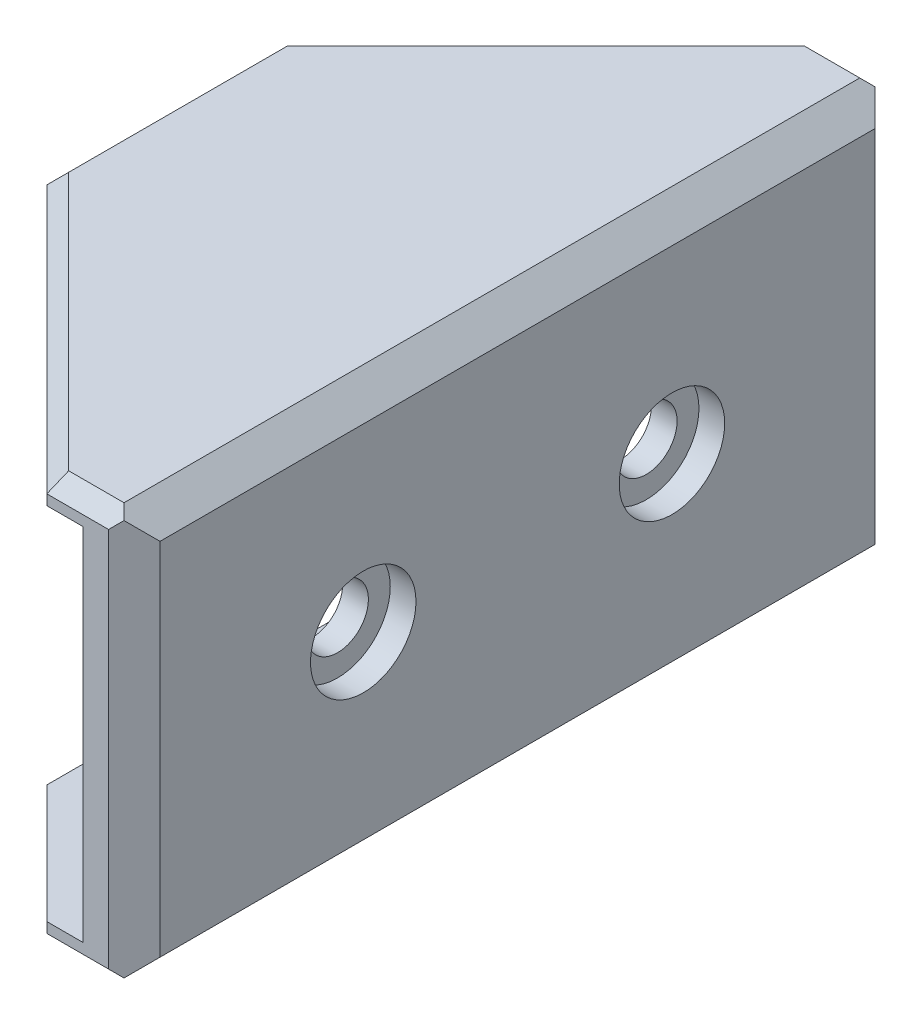
ISO-10303-21;
HEADER;
FILE_DESCRIPTION(('STEP AP214'),'2;1');
FILE_NAME('part.step','',(''),(''),'','','');
FILE_SCHEMA(('AUTOMOTIVE_DESIGN { 1 0 10303 214 1 1 1 1 }'));
ENDSEC;
DATA;
#1=APPLICATION_CONTEXT('core data for automotive mechanical design processes');
#2=APPLICATION_PROTOCOL_DEFINITION('international standard','automotive_design',2000,#1);
#3=PRODUCT_CONTEXT('',#1,'mechanical');
#4=PRODUCT('Part','Part','',(#3));
#5=PRODUCT_RELATED_PRODUCT_CATEGORY('part','',(#4));
#6=PRODUCT_DEFINITION_FORMATION('','',#4);
#7=PRODUCT_DEFINITION_CONTEXT('part definition',#1,'design');
#8=PRODUCT_DEFINITION('design','',#6,#7);
#9=PRODUCT_DEFINITION_SHAPE('','',#8);
#10=(LENGTH_UNIT() NAMED_UNIT(*) SI_UNIT(.MILLI.,.METRE.));
#11=(NAMED_UNIT(*) PLANE_ANGLE_UNIT() SI_UNIT($,.RADIAN.));
#12=(NAMED_UNIT(*) SI_UNIT($,.STERADIAN.) SOLID_ANGLE_UNIT());
#13=UNCERTAINTY_MEASURE_WITH_UNIT(LENGTH_MEASURE(1.E-05),#10,'distance_accuracy_value','');
#14=(GEOMETRIC_REPRESENTATION_CONTEXT(3) GLOBAL_UNCERTAINTY_ASSIGNED_CONTEXT((#13)) GLOBAL_UNIT_ASSIGNED_CONTEXT((#10,
#11,#12)) REPRESENTATION_CONTEXT('',''));
#15=CARTESIAN_POINT('',(0.,0.,0.));
#16=DIRECTION('',(0.,0.,1.));
#17=DIRECTION('',(1.,0.,0.));
#18=AXIS2_PLACEMENT_3D('',#15,#16,#17);
#19=CARTESIAN_POINT('',(-10.401,8.,-20.9));
#20=DIRECTION('',(1.,0.,0.));
#21=DIRECTION('',(0.,0.,-1.));
#22=AXIS2_PLACEMENT_3D('',#19,#20,#21);
#23=CYLINDRICAL_SURFACE('',#22,1.2);
#24=CARTESIAN_POINT('',(1.4,8.,-20.9));
#25=DIRECTION('',(1.,0.,0.));
#26=DIRECTION('',(0.,0.,-1.));
#27=AXIS2_PLACEMENT_3D('',#24,#25,#26);
#28=CIRCLE('',#27,1.2);
#29=CARTESIAN_POINT('',(1.4,8.,-22.1));
#30=VERTEX_POINT('',#29);
#31=EDGE_CURVE('E354',#30,#30,#28,.F.);
#32=ORIENTED_EDGE('',*,*,#31,.T.);
#33=EDGE_LOOP('',(#32));
#34=FACE_BOUND('',#33,.T.);
#35=CARTESIAN_POINT('',(2.4,8.,-20.9));
#36=DIRECTION('',(1.,0.,0.));
#37=DIRECTION('',(0.,0.,-1.));
#38=AXIS2_PLACEMENT_3D('',#35,#36,#37);
#39=CIRCLE('',#38,1.2);
#40=CARTESIAN_POINT('',(2.4,8.,-22.1));
#41=VERTEX_POINT('',#40);
#42=EDGE_CURVE('E44',#41,#41,#39,.F.);
#43=ORIENTED_EDGE('',*,*,#42,.F.);
#44=EDGE_LOOP('',(#43));
#45=FACE_BOUND('',#44,.T.);
#46=ADVANCED_FACE('F39',(#34,#45),#23,.F.);
#47=CARTESIAN_POINT('',(-10.401,8.,-8.9));
#48=DIRECTION('',(1.,0.,0.));
#49=DIRECTION('',(0.,0.,-1.));
#50=AXIS2_PLACEMENT_3D('',#47,#48,#49);
#51=CYLINDRICAL_SURFACE('',#50,1.2);
#52=CARTESIAN_POINT('',(1.4,8.,-8.9));
#53=DIRECTION('',(1.,0.,0.));
#54=DIRECTION('',(0.,0.,-1.));
#55=AXIS2_PLACEMENT_3D('',#52,#53,#54);
#56=CIRCLE('',#55,1.2);
#57=CARTESIAN_POINT('',(1.4,8.,-10.1));
#58=VERTEX_POINT('',#57);
#59=EDGE_CURVE('E341',#58,#58,#56,.F.);
#60=ORIENTED_EDGE('',*,*,#59,.T.);
#61=EDGE_LOOP('',(#60));
#62=FACE_BOUND('',#61,.T.);
#63=CARTESIAN_POINT('',(2.4,8.,-8.9));
#64=DIRECTION('',(1.,0.,0.));
#65=DIRECTION('',(0.,0.,-1.));
#66=AXIS2_PLACEMENT_3D('',#63,#64,#65);
#67=CIRCLE('',#66,1.2);
#68=CARTESIAN_POINT('',(2.4,8.,-10.1));
#69=VERTEX_POINT('',#68);
#70=EDGE_CURVE('E348',#69,#69,#67,.F.);
#71=ORIENTED_EDGE('',*,*,#70,.F.);
#72=EDGE_LOOP('',(#71));
#73=FACE_BOUND('',#72,.T.);
#74=ADVANCED_FACE('F502',(#62,#73),#51,.F.);
#75=CARTESIAN_POINT('',(-14.9,16.,-14.8999999999998));
#76=DIRECTION('',(0.707106781186552,0.,0.707106781186544));
#77=DIRECTION('',(0.707106781186544,0.,-0.707106781186551));
#78=AXIS2_PLACEMENT_3D('',#75,#76,#77);
#79=PLANE('',#78);
#80=DIRECTION('',(0.,-1.,0.));
#81=VECTOR('',#80,1.);
#82=CARTESIAN_POINT('',(0.,16.,-29.8));
#83=LINE('',#82,#81);
#84=CARTESIAN_POINT('',(0.,1.,-29.8));
#85=VERTEX_POINT('',#84);
#86=CARTESIAN_POINT('',(0.,0.600000000000003,-29.8));
#87=VERTEX_POINT('',#86);
#88=EDGE_CURVE('E238',#85,#87,#83,.T.);
#89=ORIENTED_EDGE('',*,*,#88,.T.);
#90=DIRECTION('',(-0.707106781186544,0.,0.707106781186551));
#91=VECTOR('',#90,1.);
#92=CARTESIAN_POINT('',(-14.9,0.600000000000003,-14.8999999999998));
#93=LINE('',#92,#91);
#94=CARTESIAN_POINT('',(-4.6,0.600000000000003,-25.2));
#95=VERTEX_POINT('',#94);
#96=EDGE_CURVE('E209',#87,#95,#93,.T.);
#97=ORIENTED_EDGE('',*,*,#96,.T.);
#98=DIRECTION('',(0.,-1.,0.));
#99=VECTOR('',#98,1.);
#100=CARTESIAN_POINT('',(-4.6,16.,-25.2));
#101=LINE('',#100,#99);
#102=CARTESIAN_POINT('',(-4.6,1.,-25.2));
#103=VERTEX_POINT('',#102);
#104=EDGE_CURVE('E192',#103,#95,#101,.T.);
#105=ORIENTED_EDGE('',*,*,#104,.F.);
#106=DIRECTION('',(-0.707106781186544,0.,0.707106781186551));
#107=VECTOR('',#106,1.);
#108=CARTESIAN_POINT('',(-14.9,1.,-14.8999999999998));
#109=LINE('',#108,#107);
#110=EDGE_CURVE('E206',#85,#103,#109,.T.);
#111=ORIENTED_EDGE('',*,*,#110,.F.);
#112=EDGE_LOOP('',(#89,#97,#105,#111));
#113=FACE_BOUND('',#112,.T.);
#114=ADVANCED_FACE('F205',(#113),#79,.F.);
#115=CARTESIAN_POINT('',(0.,16.,0.));
#116=DIRECTION('',(0.707106781186551,0.,-0.707106781186544));
#117=DIRECTION('',(-0.707106781186544,0.,-0.707106781186551));
#118=AXIS2_PLACEMENT_3D('',#115,#116,#117);
#119=PLANE('',#118);
#120=DIRECTION('',(0.,1.,0.));
#121=VECTOR('',#120,1.);
#122=CARTESIAN_POINT('',(-4.6,16.,-4.60000000000004));
#123=LINE('',#122,#121);
#124=CARTESIAN_POINT('',(-4.6,0.600000000000003,-4.60000000000004));
#125=VERTEX_POINT('',#124);
#126=CARTESIAN_POINT('',(-4.6,1.,-4.60000000000004));
#127=VERTEX_POINT('',#126);
#128=EDGE_CURVE('E195',#125,#127,#123,.T.);
#129=ORIENTED_EDGE('',*,*,#128,.F.);
#130=DIRECTION('',(0.707106781186544,0.,0.707106781186551));
#131=VECTOR('',#130,1.);
#132=CARTESIAN_POINT('',(0.,0.600000000000003,0.));
#133=LINE('',#132,#131);
#134=CARTESIAN_POINT('',(0.,0.600000000000003,0.));
#135=VERTEX_POINT('',#134);
#136=EDGE_CURVE('E295',#125,#135,#133,.T.);
#137=ORIENTED_EDGE('',*,*,#136,.T.);
#138=DIRECTION('',(0.,-1.,0.));
#139=VECTOR('',#138,1.);
#140=CARTESIAN_POINT('',(0.,16.,0.));
#141=LINE('',#140,#139);
#142=CARTESIAN_POINT('',(0.,1.,0.));
#143=VERTEX_POINT('',#142);
#144=EDGE_CURVE('E231',#143,#135,#141,.T.);
#145=ORIENTED_EDGE('',*,*,#144,.F.);
#146=DIRECTION('',(0.707106781186544,0.,0.707106781186551));
#147=VECTOR('',#146,1.);
#148=CARTESIAN_POINT('',(0.,1.,0.));
#149=LINE('',#148,#147);
#150=EDGE_CURVE('E210',#127,#143,#149,.T.);
#151=ORIENTED_EDGE('',*,*,#150,.F.);
#152=EDGE_LOOP('',(#129,#137,#145,#151));
#153=FACE_BOUND('',#152,.T.);
#154=ADVANCED_FACE('F445',(#153),#119,.F.);
#155=CARTESIAN_POINT('',(0.,0.,0.));
#156=DIRECTION('',(0.,1.,0.));
#157=DIRECTION('',(0.,0.,1.));
#158=AXIS2_PLACEMENT_3D('',#155,#156,#157);
#159=PLANE('',#158);
#160=DIRECTION('',(0.,0.,1.));
#161=VECTOR('',#160,1.);
#162=CARTESIAN_POINT('',(2.40000000000001,0.,0.));
#163=LINE('',#162,#161);
#164=CARTESIAN_POINT('',(2.4,0.,-29.2));
#165=VERTEX_POINT('',#164);
#166=CARTESIAN_POINT('',(2.40000000000001,0.,-0.600000000000008));
#167=VERTEX_POINT('',#166);
#168=EDGE_CURVE('E258',#165,#167,#163,.T.);
#169=ORIENTED_EDGE('',*,*,#168,.T.);
#170=DIRECTION('',(-1.,0.,0.));
#171=VECTOR('',#170,1.);
#172=CARTESIAN_POINT('',(0.,0.,-0.600000000000008));
#173=LINE('',#172,#171);
#174=CARTESIAN_POINT('',(0.248528137423862,0.,-0.600000000000008));
#175=VERTEX_POINT('',#174);
#176=EDGE_CURVE('E280',#167,#175,#173,.T.);
#177=ORIENTED_EDGE('',*,*,#176,.T.);
#178=DIRECTION('',(-0.707106781186544,0.,-0.707106781186551));
#179=VECTOR('',#178,1.);
#180=CARTESIAN_POINT('',(0.424264068711937,0.,-0.424264068711933));
#181=LINE('',#180,#179);
#182=CARTESIAN_POINT('',(-3.99999999999999,0.,-4.8485281374239));
#183=VERTEX_POINT('',#182);
#184=EDGE_CURVE('E278',#175,#183,#181,.T.);
#185=ORIENTED_EDGE('',*,*,#184,.T.);
#186=DIRECTION('',(0.,0.,-1.));
#187=VECTOR('',#186,1.);
#188=CARTESIAN_POINT('',(-3.99999999999999,0.,-25.2));
#189=LINE('',#188,#187);
#190=CARTESIAN_POINT('',(-3.99999999999999,0.,-24.9514718625761));
#191=VERTEX_POINT('',#190);
#192=EDGE_CURVE('E276',#183,#191,#189,.T.);
#193=ORIENTED_EDGE('',*,*,#192,.T.);
#194=DIRECTION('',(0.707106781186544,0.,-0.707106781186551));
#195=VECTOR('',#194,1.);
#196=CARTESIAN_POINT('',(-14.4757359312881,0.,-14.4757359312879));
#197=LINE('',#196,#195);
#198=CARTESIAN_POINT('',(0.248528137423864,0.,-29.2));
#199=VERTEX_POINT('',#198);
#200=EDGE_CURVE('E261',#191,#199,#197,.T.);
#201=ORIENTED_EDGE('',*,*,#200,.T.);
#202=DIRECTION('',(1.,0.,0.));
#203=VECTOR('',#202,1.);
#204=CARTESIAN_POINT('',(2.4,0.,-29.2));
#205=LINE('',#204,#203);
#206=EDGE_CURVE('E274',#199,#165,#205,.T.);
#207=ORIENTED_EDGE('',*,*,#206,.T.);
#208=EDGE_LOOP('',(#169,#177,#185,#193,#201,#207));
#209=FACE_BOUND('',#208,.T.);
#210=ADVANCED_FACE('F458',(#209),#159,.F.);
#211=CARTESIAN_POINT('',(0.,1.,0.));
#212=DIRECTION('',(0.,1.,0.));
#213=DIRECTION('',(0.,0.,1.));
#214=AXIS2_PLACEMENT_3D('',#211,#212,#213);
#215=PLANE('',#214);
#216=ORIENTED_EDGE('',*,*,#110,.T.);
#217=DIRECTION('',(0.,0.,1.));
#218=VECTOR('',#217,1.);
#219=CARTESIAN_POINT('',(-4.6,1.,0.));
#220=LINE('',#219,#218);
#221=EDGE_CURVE('E189',#103,#127,#220,.T.);
#222=ORIENTED_EDGE('',*,*,#221,.T.);
#223=ORIENTED_EDGE('',*,*,#150,.T.);
#224=DIRECTION('',(-1.,0.,0.));
#225=VECTOR('',#224,1.);
#226=CARTESIAN_POINT('',(0.,1.,0.));
#227=LINE('',#226,#225);
#228=CARTESIAN_POINT('',(1.4,1.,0.));
#229=VERTEX_POINT('',#228);
#230=EDGE_CURVE('E388',#229,#143,#227,.T.);
#231=ORIENTED_EDGE('',*,*,#230,.F.);
#232=DIRECTION('',(0.,0.,1.));
#233=VECTOR('',#232,1.);
#234=CARTESIAN_POINT('',(1.4,1.,0.));
#235=LINE('',#234,#233);
#236=CARTESIAN_POINT('',(1.4,1.,-29.8));
#237=VERTEX_POINT('',#236);
#238=EDGE_CURVE('E221',#237,#229,#235,.T.);
#239=ORIENTED_EDGE('',*,*,#238,.F.);
#240=DIRECTION('',(1.,0.,0.));
#241=VECTOR('',#240,1.);
#242=CARTESIAN_POINT('',(0.,1.,-29.8));
#243=LINE('',#242,#241);
#244=EDGE_CURVE('E215',#85,#237,#243,.T.);
#245=ORIENTED_EDGE('',*,*,#244,.F.);
#246=EDGE_LOOP('',(#216,#222,#223,#231,#239,#245));
#247=FACE_BOUND('',#246,.T.);
#248=ADVANCED_FACE('F212',(#247),#215,.T.);
#249=CARTESIAN_POINT('',(0.,16.,0.));
#250=DIRECTION('',(0.,0.,1.));
#251=DIRECTION('',(1.,0.,0.));
#252=AXIS2_PLACEMENT_3D('',#249,#250,#251);
#253=PLANE('',#252);
#254=ORIENTED_EDGE('',*,*,#144,.T.);
#255=DIRECTION('',(1.,0.,0.));
#256=VECTOR('',#255,1.);
#257=CARTESIAN_POINT('',(2.40000000000001,0.600000000000003,0.));
#258=LINE('',#257,#256);
#259=CARTESIAN_POINT('',(2.40000000000001,0.600000000000003,0.));
#260=VERTEX_POINT('',#259);
#261=EDGE_CURVE('E285',#135,#260,#258,.T.);
#262=ORIENTED_EDGE('',*,*,#261,.T.);
#263=DIRECTION('',(0.,1.,0.));
#264=VECTOR('',#263,1.);
#265=CARTESIAN_POINT('',(2.40000000000001,16.,0.));
#266=LINE('',#265,#264);
#267=CARTESIAN_POINT('',(2.40000000000001,15.4,0.));
#268=VERTEX_POINT('',#267);
#269=EDGE_CURVE('E255',#260,#268,#266,.T.);
#270=ORIENTED_EDGE('',*,*,#269,.T.);
#271=DIRECTION('',(-1.,0.,0.));
#272=VECTOR('',#271,1.);
#273=CARTESIAN_POINT('',(0.,15.4,0.));
#274=LINE('',#273,#272);
#275=CARTESIAN_POINT('',(0.,15.4,0.));
#276=VERTEX_POINT('',#275);
#277=EDGE_CURVE('E283',#268,#276,#274,.T.);
#278=ORIENTED_EDGE('',*,*,#277,.T.);
#279=CARTESIAN_POINT('',(0.,15.,0.));
#280=VERTEX_POINT('',#279);
#281=EDGE_CURVE('E232',#276,#280,#141,.T.);
#282=ORIENTED_EDGE('',*,*,#281,.T.);
#283=DIRECTION('',(-1.,0.,0.));
#284=VECTOR('',#283,1.);
#285=CARTESIAN_POINT('',(0.,15.,0.));
#286=LINE('',#285,#284);
#287=CARTESIAN_POINT('',(1.4,15.,0.));
#288=VERTEX_POINT('',#287);
#289=EDGE_CURVE('E376',#288,#280,#286,.T.);
#290=ORIENTED_EDGE('',*,*,#289,.F.);
#291=DIRECTION('',(0.,-1.,0.));
#292=VECTOR('',#291,1.);
#293=CARTESIAN_POINT('',(1.4,15.,0.));
#294=LINE('',#293,#292);
#295=EDGE_CURVE('E227',#288,#229,#294,.T.);
#296=ORIENTED_EDGE('',*,*,#295,.T.);
#297=ORIENTED_EDGE('',*,*,#230,.T.);
#298=EDGE_LOOP('',(#254,#262,#270,#278,#282,#290,#296,#297));
#299=FACE_BOUND('',#298,.T.);
#300=ADVANCED_FACE('F397',(#299),#253,.T.);
#301=CARTESIAN_POINT('',(3.4,16.,0.));
#302=DIRECTION('',(1.,0.,0.));
#303=DIRECTION('',(0.,0.,-1.));
#304=AXIS2_PLACEMENT_3D('',#301,#302,#303);
#305=PLANE('',#304);
#306=CARTESIAN_POINT('',(3.4,8.,-8.9));
#307=DIRECTION('',(1.,0.,0.));
#308=DIRECTION('',(0.,0.,-1.));
#309=AXIS2_PLACEMENT_3D('',#306,#307,#308);
#310=CIRCLE('',#309,2.05);
#311=CARTESIAN_POINT('',(3.4,8.,-10.95));
#312=VERTEX_POINT('',#311);
#313=EDGE_CURVE('E356',#312,#312,#310,.T.);
#314=ORIENTED_EDGE('',*,*,#313,.F.);
#315=EDGE_LOOP('',(#314));
#316=FACE_BOUND('',#315,.T.);
#317=CARTESIAN_POINT('',(3.4,8.,-20.9));
#318=DIRECTION('',(1.,0.,0.));
#319=DIRECTION('',(0.,0.,-1.));
#320=AXIS2_PLACEMENT_3D('',#317,#318,#319);
#321=CIRCLE('',#320,2.05);
#322=CARTESIAN_POINT('',(3.4,8.,-22.95));
#323=VERTEX_POINT('',#322);
#324=EDGE_CURVE('E366',#323,#323,#321,.T.);
#325=ORIENTED_EDGE('',*,*,#324,.F.);
#326=EDGE_LOOP('',(#325));
#327=FACE_BOUND('',#326,.T.);
#328=DIRECTION('',(0.,0.,-1.));
#329=VECTOR('',#328,1.);
#330=CARTESIAN_POINT('',(3.4,0.999999999999997,-29.8));
#331=LINE('',#330,#329);
#332=CARTESIAN_POINT('',(3.4,0.999999999999997,-0.999999999999998));
#333=VERTEX_POINT('',#332);
#334=CARTESIAN_POINT('',(3.4,0.999999999999997,-28.8));
#335=VERTEX_POINT('',#334);
#336=EDGE_CURVE('E242',#333,#335,#331,.T.);
#337=ORIENTED_EDGE('',*,*,#336,.T.);
#338=DIRECTION('',(0.,1.,0.));
#339=VECTOR('',#338,1.);
#340=CARTESIAN_POINT('',(3.4,16.,-28.8));
#341=LINE('',#340,#339);
#342=CARTESIAN_POINT('',(3.4,15.,-28.8));
#343=VERTEX_POINT('',#342);
#344=EDGE_CURVE('E249',#335,#343,#341,.T.);
#345=ORIENTED_EDGE('',*,*,#344,.T.);
#346=DIRECTION('',(0.,0.,1.));
#347=VECTOR('',#346,1.);
#348=CARTESIAN_POINT('',(3.4,15.,0.));
#349=LINE('',#348,#347);
#350=CARTESIAN_POINT('',(3.4,15.,-0.999999999999998));
#351=VERTEX_POINT('',#350);
#352=EDGE_CURVE('E246',#343,#351,#349,.T.);
#353=ORIENTED_EDGE('',*,*,#352,.T.);
#354=DIRECTION('',(0.,-1.,0.));
#355=VECTOR('',#354,1.);
#356=CARTESIAN_POINT('',(3.4,16.,-0.999999999999998));
#357=LINE('',#356,#355);
#358=EDGE_CURVE('E244',#351,#333,#357,.T.);
#359=ORIENTED_EDGE('',*,*,#358,.T.);
#360=EDGE_LOOP('',(#337,#345,#353,#359));
#361=FACE_BOUND('',#360,.T.);
#362=ADVANCED_FACE('F489',(#316,#327,#361),#305,.T.);
#363=CARTESIAN_POINT('',(0.,16.,-29.8));
#364=DIRECTION('',(0.,0.,-1.));
#365=DIRECTION('',(-1.,0.,0.));
#366=AXIS2_PLACEMENT_3D('',#363,#364,#365);
#367=PLANE('',#366);
#368=DIRECTION('',(0.,-1.,0.));
#369=VECTOR('',#368,1.);
#370=CARTESIAN_POINT('',(2.4,16.,-29.8));
#371=LINE('',#370,#369);
#372=CARTESIAN_POINT('',(2.4,15.4,-29.8));
#373=VERTEX_POINT('',#372);
#374=CARTESIAN_POINT('',(2.4,0.600000000000003,-29.8));
#375=VERTEX_POINT('',#374);
#376=EDGE_CURVE('E199',#373,#375,#371,.T.);
#377=ORIENTED_EDGE('',*,*,#376,.T.);
#378=DIRECTION('',(-1.,0.,0.));
#379=VECTOR('',#378,1.);
#380=CARTESIAN_POINT('',(0.,0.600000000000003,-29.8));
#381=LINE('',#380,#379);
#382=EDGE_CURVE('E306',#375,#87,#381,.T.);
#383=ORIENTED_EDGE('',*,*,#382,.T.);
#384=ORIENTED_EDGE('',*,*,#88,.F.);
#385=ORIENTED_EDGE('',*,*,#244,.T.);
#386=DIRECTION('',(0.,-1.,0.));
#387=VECTOR('',#386,1.);
#388=CARTESIAN_POINT('',(1.4,15.,-29.8));
#389=LINE('',#388,#387);
#390=CARTESIAN_POINT('',(1.4,15.,-29.8));
#391=VERTEX_POINT('',#390);
#392=EDGE_CURVE('E225',#391,#237,#389,.T.);
#393=ORIENTED_EDGE('',*,*,#392,.F.);
#394=DIRECTION('',(1.,0.,0.));
#395=VECTOR('',#394,1.);
#396=CARTESIAN_POINT('',(0.,15.,-29.8));
#397=LINE('',#396,#395);
#398=CARTESIAN_POINT('',(0.,15.,-29.8));
#399=VERTEX_POINT('',#398);
#400=EDGE_CURVE('E382',#399,#391,#397,.T.);
#401=ORIENTED_EDGE('',*,*,#400,.F.);
#402=CARTESIAN_POINT('',(0.,15.4,-29.8));
#403=VERTEX_POINT('',#402);
#404=EDGE_CURVE('E200',#403,#399,#83,.T.);
#405=ORIENTED_EDGE('',*,*,#404,.F.);
#406=DIRECTION('',(1.,0.,0.));
#407=VECTOR('',#406,1.);
#408=CARTESIAN_POINT('',(0.,15.4,-29.8));
#409=LINE('',#408,#407);
#410=EDGE_CURVE('E303',#403,#373,#409,.T.);
#411=ORIENTED_EDGE('',*,*,#410,.T.);
#412=EDGE_LOOP('',(#377,#383,#384,#385,#393,#401,#405,#411));
#413=FACE_BOUND('',#412,.T.);
#414=ADVANCED_FACE('F426',(#413),#367,.T.);
#415=DIRECTION('',(0.,-1.,0.));
#416=VECTOR('',#415,1.);
#417=CARTESIAN_POINT('',(-10.4,16.,-19.3999999999999));
#418=LINE('',#417,#416);
#419=CARTESIAN_POINT('',(-10.4,15.4,-19.3999999999999));
#420=VERTEX_POINT('',#419);
#421=CARTESIAN_POINT('',(-10.4,15.,-19.3999999999999));
#422=VERTEX_POINT('',#421);
#423=EDGE_CURVE('E236',#420,#422,#418,.T.);
#424=ORIENTED_EDGE('',*,*,#423,.F.);
#425=DIRECTION('',(0.707106781186544,0.,-0.707106781186551));
#426=VECTOR('',#425,1.);
#427=CARTESIAN_POINT('',(0.,15.4,-29.8));
#428=LINE('',#427,#426);
#429=EDGE_CURVE('E323',#420,#403,#428,.T.);
#430=ORIENTED_EDGE('',*,*,#429,.T.);
#431=ORIENTED_EDGE('',*,*,#404,.T.);
#432=DIRECTION('',(-0.707106781186544,0.,0.707106781186551));
#433=VECTOR('',#432,1.);
#434=CARTESIAN_POINT('',(-14.9,15.,-14.8999999999998));
#435=LINE('',#434,#433);
#436=EDGE_CURVE('E228',#399,#422,#435,.T.);
#437=ORIENTED_EDGE('',*,*,#436,.T.);
#438=EDGE_LOOP('',(#424,#430,#431,#437));
#439=FACE_BOUND('',#438,.T.);
#440=ADVANCED_FACE('F422',(#439),#79,.F.);
#441=CARTESIAN_POINT('',(-10.4,16.,0.));
#442=DIRECTION('',(1.,0.,0.));
#443=DIRECTION('',(0.,0.,-1.));
#444=AXIS2_PLACEMENT_3D('',#441,#442,#443);
#445=PLANE('',#444);
#446=DIRECTION('',(0.,-1.,0.));
#447=VECTOR('',#446,1.);
#448=CARTESIAN_POINT('',(-10.4,16.,-10.4000000000001));
#449=LINE('',#448,#447);
#450=CARTESIAN_POINT('',(-10.4,15.4,-10.4000000000001));
#451=VERTEX_POINT('',#450);
#452=CARTESIAN_POINT('',(-10.4,15.,-10.4000000000001));
#453=VERTEX_POINT('',#452);
#454=EDGE_CURVE('E234',#451,#453,#449,.T.);
#455=ORIENTED_EDGE('',*,*,#454,.F.);
#456=DIRECTION('',(0.,0.,-1.));
#457=VECTOR('',#456,1.);
#458=CARTESIAN_POINT('',(-10.4,15.4,-19.3999999999999));
#459=LINE('',#458,#457);
#460=EDGE_CURVE('E11',#451,#420,#459,.T.);
#461=ORIENTED_EDGE('',*,*,#460,.T.);
#462=ORIENTED_EDGE('',*,*,#423,.T.);
#463=DIRECTION('',(0.,0.,1.));
#464=VECTOR('',#463,1.);
#465=CARTESIAN_POINT('',(-10.4,15.,0.));
#466=LINE('',#465,#464);
#467=EDGE_CURVE('E216',#422,#453,#466,.T.);
#468=ORIENTED_EDGE('',*,*,#467,.T.);
#469=EDGE_LOOP('',(#455,#461,#462,#468));
#470=FACE_BOUND('',#469,.T.);
#471=ADVANCED_FACE('F406',(#470),#445,.F.);
#472=ORIENTED_EDGE('',*,*,#281,.F.);
#473=DIRECTION('',(-0.707106781186544,0.,-0.707106781186551));
#474=VECTOR('',#473,1.);
#475=CARTESIAN_POINT('',(-10.4,15.4,-10.4000000000001));
#476=LINE('',#475,#474);
#477=EDGE_CURVE('E49',#276,#451,#476,.T.);
#478=ORIENTED_EDGE('',*,*,#477,.T.);
#479=ORIENTED_EDGE('',*,*,#454,.T.);
#480=DIRECTION('',(0.707106781186544,0.,0.707106781186551));
#481=VECTOR('',#480,1.);
#482=CARTESIAN_POINT('',(0.,15.,0.));
#483=LINE('',#482,#481);
#484=EDGE_CURVE('E219',#453,#280,#483,.T.);
#485=ORIENTED_EDGE('',*,*,#484,.T.);
#486=EDGE_LOOP('',(#472,#478,#479,#485));
#487=FACE_BOUND('',#486,.T.);
#488=ADVANCED_FACE('F403',(#487),#119,.F.);
#489=CARTESIAN_POINT('',(0.,16.,0.));
#490=DIRECTION('',(0.,1.,0.));
#491=DIRECTION('',(0.,0.,1.));
#492=AXIS2_PLACEMENT_3D('',#489,#490,#491);
#493=PLANE('',#492);
#494=DIRECTION('',(0.,0.,-1.));
#495=VECTOR('',#494,1.);
#496=CARTESIAN_POINT('',(2.40000000000001,16.,0.));
#497=LINE('',#496,#495);
#498=CARTESIAN_POINT('',(2.40000000000001,16.,-0.6));
#499=VERTEX_POINT('',#498);
#500=CARTESIAN_POINT('',(2.4,16.,-29.2));
#501=VERTEX_POINT('',#500);
#502=EDGE_CURVE('E252',#499,#501,#497,.T.);
#503=ORIENTED_EDGE('',*,*,#502,.T.);
#504=DIRECTION('',(-1.,0.,0.));
#505=VECTOR('',#504,1.);
#506=CARTESIAN_POINT('',(0.,16.,-29.2));
#507=LINE('',#506,#505);
#508=CARTESIAN_POINT('',(0.248528137423853,16.,-29.2));
#509=VERTEX_POINT('',#508);
#510=EDGE_CURVE('E321',#501,#509,#507,.T.);
#511=ORIENTED_EDGE('',*,*,#510,.T.);
#512=DIRECTION('',(-0.707106781186544,0.,0.707106781186551));
#513=VECTOR('',#512,1.);
#514=CARTESIAN_POINT('',(-9.97573593128807,16.,-18.975735931288));
#515=LINE('',#514,#513);
#516=CARTESIAN_POINT('',(-9.8,16.,-19.151471862576));
#517=VERTEX_POINT('',#516);
#518=EDGE_CURVE('E317',#509,#517,#515,.T.);
#519=ORIENTED_EDGE('',*,*,#518,.T.);
#520=DIRECTION('',(0.,0.,1.));
#521=VECTOR('',#520,1.);
#522=CARTESIAN_POINT('',(-9.8,16.,-10.4000000000001));
#523=LINE('',#522,#521);
#524=CARTESIAN_POINT('',(-9.8,16.,-10.648528137424));
#525=VERTEX_POINT('',#524);
#526=EDGE_CURVE('E313',#517,#525,#523,.T.);
#527=ORIENTED_EDGE('',*,*,#526,.T.);
#528=DIRECTION('',(0.707106781186544,0.,0.707106781186551));
#529=VECTOR('',#528,1.);
#530=CARTESIAN_POINT('',(0.424264068711931,16.,-0.424264068711926));
#531=LINE('',#530,#529);
#532=CARTESIAN_POINT('',(0.248528137423859,16.,-0.6));
#533=VERTEX_POINT('',#532);
#534=EDGE_CURVE('E315',#525,#533,#531,.T.);
#535=ORIENTED_EDGE('',*,*,#534,.T.);
#536=DIRECTION('',(1.,0.,0.));
#537=VECTOR('',#536,1.);
#538=CARTESIAN_POINT('',(0.,16.,-0.6));
#539=LINE('',#538,#537);
#540=EDGE_CURVE('E319',#533,#499,#539,.T.);
#541=ORIENTED_EDGE('',*,*,#540,.T.);
#542=EDGE_LOOP('',(#503,#511,#519,#527,#535,#541));
#543=FACE_BOUND('',#542,.T.);
#544=ADVANCED_FACE('F476',(#543),#493,.T.);
#545=CARTESIAN_POINT('',(1.4,15.,0.));
#546=DIRECTION('',(1.,0.,0.));
#547=DIRECTION('',(0.,0.,-1.));
#548=AXIS2_PLACEMENT_3D('',#545,#546,#547);
#549=PLANE('',#548);
#550=ORIENTED_EDGE('',*,*,#59,.F.);
#551=EDGE_LOOP('',(#550));
#552=FACE_BOUND('',#551,.T.);
#553=ORIENTED_EDGE('',*,*,#31,.F.);
#554=EDGE_LOOP('',(#553));
#555=FACE_BOUND('',#554,.T.);
#556=ORIENTED_EDGE('',*,*,#238,.T.);
#557=ORIENTED_EDGE('',*,*,#295,.F.);
#558=DIRECTION('',(0.,0.,1.));
#559=VECTOR('',#558,1.);
#560=CARTESIAN_POINT('',(1.4,15.,0.));
#561=LINE('',#560,#559);
#562=EDGE_CURVE('E379',#391,#288,#561,.T.);
#563=ORIENTED_EDGE('',*,*,#562,.F.);
#564=ORIENTED_EDGE('',*,*,#392,.T.);
#565=EDGE_LOOP('',(#556,#557,#563,#564));
#566=FACE_BOUND('',#565,.T.);
#567=ADVANCED_FACE('F392',(#552,#555,#566),#549,.F.);
#568=CARTESIAN_POINT('',(0.,15.,0.));
#569=DIRECTION('',(0.,1.,0.));
#570=DIRECTION('',(0.,0.,1.));
#571=AXIS2_PLACEMENT_3D('',#568,#569,#570);
#572=PLANE('',#571);
#573=ORIENTED_EDGE('',*,*,#467,.F.);
#574=ORIENTED_EDGE('',*,*,#436,.F.);
#575=ORIENTED_EDGE('',*,*,#400,.T.);
#576=ORIENTED_EDGE('',*,*,#562,.T.);
#577=ORIENTED_EDGE('',*,*,#289,.T.);
#578=ORIENTED_EDGE('',*,*,#484,.F.);
#579=EDGE_LOOP('',(#573,#574,#575,#576,#577,#578));
#580=FACE_BOUND('',#579,.T.);
#581=ADVANCED_FACE('F402',(#580),#572,.F.);
#582=CARTESIAN_POINT('',(-4.6,0.,0.));
#583=DIRECTION('',(-1.,0.,0.));
#584=DIRECTION('',(0.,0.,1.));
#585=AXIS2_PLACEMENT_3D('',#582,#583,#584);
#586=PLANE('',#585);
#587=ORIENTED_EDGE('',*,*,#104,.T.);
#588=DIRECTION('',(0.,0.,1.));
#589=VECTOR('',#588,1.);
#590=CARTESIAN_POINT('',(-4.6,0.600000000000003,-4.60000000000004));
#591=LINE('',#590,#589);
#592=EDGE_CURVE('E297',#95,#125,#591,.T.);
#593=ORIENTED_EDGE('',*,*,#592,.T.);
#594=ORIENTED_EDGE('',*,*,#128,.T.);
#595=ORIENTED_EDGE('',*,*,#221,.F.);
#596=EDGE_LOOP('',(#587,#593,#594,#595));
#597=FACE_BOUND('',#596,.T.);
#598=ADVANCED_FACE('F191',(#597),#586,.T.);
#599=CARTESIAN_POINT('',(3.4,16.,-0.999999999999998));
#600=DIRECTION('',(-0.707106781186548,0.,-0.707106781186547));
#601=DIRECTION('',(0.,-1.,0.));
#602=AXIS2_PLACEMENT_3D('',#599,#600,#601);
#603=PLANE('',#602);
#604=ORIENTED_EDGE('',*,*,#269,.F.);
#605=DIRECTION('',(-0.577350269189627,0.577350269189623,0.577350269189627));
#606=VECTOR('',#605,1.);
#607=CARTESIAN_POINT('',(-2.06666666666664,5.06666666666661,4.46666666666665));
#608=LINE('',#607,#606);
#609=CARTESIAN_POINT('',(2.70000000000001,0.300000000000003,-0.300000000000003));
#610=VERTEX_POINT('',#609);
#611=EDGE_CURVE('E289',#260,#610,#608,.F.);
#612=ORIENTED_EDGE('',*,*,#611,.T.);
#613=DIRECTION('',(0.577350269189626,0.577350269189626,-0.577350269189626));
#614=VECTOR('',#613,1.);
#615=CARTESIAN_POINT('',(2.40000000000001,0.,0.));
#616=LINE('',#615,#614);
#617=EDGE_CURVE('E268',#333,#610,#616,.F.);
#618=ORIENTED_EDGE('',*,*,#617,.F.);
#619=ORIENTED_EDGE('',*,*,#358,.F.);
#620=DIRECTION('',(-0.577350269189626,0.577350269189626,0.577350269189626));
#621=VECTOR('',#620,1.);
#622=CARTESIAN_POINT('',(3.06666666666667,15.3333333333333,-0.666666666666665));
#623=LINE('',#622,#621);
#624=CARTESIAN_POINT('',(2.70000000000001,15.7,-0.300000000000002));
#625=VERTEX_POINT('',#624);
#626=EDGE_CURVE('E271',#625,#351,#623,.F.);
#627=ORIENTED_EDGE('',*,*,#626,.F.);
#628=DIRECTION('',(-0.577350269189625,-0.577350269189628,0.577350269189625));
#629=VECTOR('',#628,1.);
#630=CARTESIAN_POINT('',(3.26666666666667,16.2666666666667,-0.866666666666664));
#631=LINE('',#630,#629);
#632=EDGE_CURVE('E287',#625,#268,#631,.T.);
#633=ORIENTED_EDGE('',*,*,#632,.T.);
#634=EDGE_LOOP('',(#604,#612,#618,#619,#627,#633));
#635=FACE_BOUND('',#634,.T.);
#636=ADVANCED_FACE('F467',(#635),#603,.F.);
#637=CARTESIAN_POINT('',(3.4,15.,0.));
#638=DIRECTION('',(-0.707106781186548,-0.707106781186548,0.));
#639=DIRECTION('',(0.,0.,1.));
#640=AXIS2_PLACEMENT_3D('',#637,#638,#639);
#641=PLANE('',#640);
#642=DIRECTION('',(-0.577350269189626,0.577350269189626,-0.577350269189626));
#643=VECTOR('',#642,1.);
#644=CARTESIAN_POINT('',(13.,5.4,-19.2));
#645=LINE('',#644,#643);
#646=CARTESIAN_POINT('',(2.7,15.7,-29.5));
#647=VERTEX_POINT('',#646);
#648=EDGE_CURVE('E265',#647,#343,#645,.F.);
#649=ORIENTED_EDGE('',*,*,#648,.F.);
#650=DIRECTION('',(-0.577350269189627,0.577350269189627,0.577350269189624));
#651=VECTOR('',#650,1.);
#652=CARTESIAN_POINT('',(-6.66666666666664,25.0666666666666,-20.1333333333334));
#653=LINE('',#652,#651);
#654=EDGE_CURVE('E311',#647,#501,#653,.T.);
#655=ORIENTED_EDGE('',*,*,#654,.T.);
#656=ORIENTED_EDGE('',*,*,#502,.F.);
#657=DIRECTION('',(0.577350269189627,-0.577350269189627,0.577350269189624));
#658=VECTOR('',#657,1.);
#659=CARTESIAN_POINT('',(3.26666666666667,15.1333333333333,0.266666666666662));
#660=LINE('',#659,#658);
#661=EDGE_CURVE('E309',#499,#625,#660,.T.);
#662=ORIENTED_EDGE('',*,*,#661,.T.);
#663=ORIENTED_EDGE('',*,*,#626,.T.);
#664=ORIENTED_EDGE('',*,*,#352,.F.);
#665=EDGE_LOOP('',(#649,#655,#656,#662,#663,#664));
#666=FACE_BOUND('',#665,.T.);
#667=ADVANCED_FACE('F480',(#666),#641,.F.);
#668=CARTESIAN_POINT('',(2.40000000000001,0.,0.));
#669=DIRECTION('',(0.707106781186548,-0.707106781186548,0.));
#670=DIRECTION('',(0.,0.,-1.));
#671=AXIS2_PLACEMENT_3D('',#668,#669,#670);
#672=PLANE('',#671);
#673=ORIENTED_EDGE('',*,*,#617,.T.);
#674=DIRECTION('',(-0.577350269189624,-0.577350269189624,-0.577350269189629));
#675=VECTOR('',#674,1.);
#676=CARTESIAN_POINT('',(2.60000000000001,0.200000000000003,-0.400000000000003));
#677=LINE('',#676,#675);
#678=EDGE_CURVE('E293',#610,#167,#677,.T.);
#679=ORIENTED_EDGE('',*,*,#678,.T.);
#680=ORIENTED_EDGE('',*,*,#168,.F.);
#681=DIRECTION('',(0.577350269189625,0.577350269189625,-0.577350269189628));
#682=VECTOR('',#681,1.);
#683=CARTESIAN_POINT('',(-7.33333333333335,-9.73333333333335,-19.4666666666666));
#684=LINE('',#683,#682);
#685=CARTESIAN_POINT('',(2.7,0.300000000000002,-29.5));
#686=VERTEX_POINT('',#685);
#687=EDGE_CURVE('E291',#165,#686,#684,.T.);
#688=ORIENTED_EDGE('',*,*,#687,.T.);
#689=DIRECTION('',(-0.577350269189626,-0.577350269189626,-0.577350269189626));
#690=VECTOR('',#689,1.);
#691=CARTESIAN_POINT('',(12.3333333333333,9.93333333333333,-19.8666666666667));
#692=LINE('',#691,#690);
#693=EDGE_CURVE('E262',#335,#686,#692,.T.);
#694=ORIENTED_EDGE('',*,*,#693,.F.);
#695=ORIENTED_EDGE('',*,*,#336,.F.);
#696=EDGE_LOOP('',(#673,#679,#680,#688,#694,#695));
#697=FACE_BOUND('',#696,.T.);
#698=ADVANCED_FACE('F461',(#697),#672,.T.);
#699=CARTESIAN_POINT('',(2.4,16.,-29.8));
#700=DIRECTION('',(-0.707106781186548,0.,0.707106781186548));
#701=DIRECTION('',(0.,-1.,0.));
#702=AXIS2_PLACEMENT_3D('',#699,#700,#701);
#703=PLANE('',#702);
#704=ORIENTED_EDGE('',*,*,#693,.T.);
#705=DIRECTION('',(0.577350269189627,-0.577350269189624,0.577350269189627));
#706=VECTOR('',#705,1.);
#707=CARTESIAN_POINT('',(-2.73333333333332,5.7333333333333,-34.9333333333333));
#708=LINE('',#707,#706);
#709=EDGE_CURVE('E301',#686,#375,#708,.F.);
#710=ORIENTED_EDGE('',*,*,#709,.T.);
#711=ORIENTED_EDGE('',*,*,#376,.F.);
#712=DIRECTION('',(0.577350269189625,0.577350269189628,0.577350269189625));
#713=VECTOR('',#712,1.);
#714=CARTESIAN_POINT('',(2.6,15.6,-29.6));
#715=LINE('',#714,#713);
#716=EDGE_CURVE('E299',#373,#647,#715,.T.);
#717=ORIENTED_EDGE('',*,*,#716,.T.);
#718=ORIENTED_EDGE('',*,*,#648,.T.);
#719=ORIENTED_EDGE('',*,*,#344,.F.);
#720=EDGE_LOOP('',(#704,#710,#711,#717,#718,#719));
#721=FACE_BOUND('',#720,.T.);
#722=ADVANCED_FACE('F486',(#721),#703,.F.);
#723=CARTESIAN_POINT('',(0.,0.,-29.2));
#724=DIRECTION('',(0.,-0.70710678118655,-0.707106781186545));
#725=DIRECTION('',(-1.,0.,0.));
#726=AXIS2_PLACEMENT_3D('',#723,#724,#725);
#727=PLANE('',#726);
#728=ORIENTED_EDGE('',*,*,#687,.F.);
#729=ORIENTED_EDGE('',*,*,#206,.F.);
#730=DIRECTION('',(-0.281084637714831,0.678598344545843,-0.678598344545847));
#731=VECTOR('',#730,1.);
#732=CARTESIAN_POINT('',(1.66485144444203,-3.41930693650823,-25.7806930634917));
#733=LINE('',#732,#731);
#734=EDGE_CURVE('E266',#87,#199,#733,.F.);
#735=ORIENTED_EDGE('',*,*,#734,.F.);
#736=ORIENTED_EDGE('',*,*,#382,.F.);
#737=ORIENTED_EDGE('',*,*,#709,.F.);
#738=EDGE_LOOP('',(#728,#729,#735,#736,#737));
#739=FACE_BOUND('',#738,.T.);
#740=ADVANCED_FACE('F433',(#739),#727,.T.);
#741=CARTESIAN_POINT('',(-14.9,0.600000000000003,-14.8999999999998));
#742=DIRECTION('',(0.499999999999999,0.707106781186553,0.499999999999994));
#743=DIRECTION('',(-0.707106781186544,0.,0.707106781186551));
#744=AXIS2_PLACEMENT_3D('',#741,#742,#743);
#745=PLANE('',#744);
#746=ORIENTED_EDGE('',*,*,#734,.T.);
#747=ORIENTED_EDGE('',*,*,#200,.F.);
#748=DIRECTION('',(0.678598344545849,-0.678598344545843,0.281084637714824));
#749=VECTOR('',#748,1.);
#750=CARTESIAN_POINT('',(-7.3784470769151,3.37844707691508,-26.3508704615941));
#751=LINE('',#750,#749);
#752=EDGE_CURVE('E332',#95,#191,#751,.T.);
#753=ORIENTED_EDGE('',*,*,#752,.F.);
#754=ORIENTED_EDGE('',*,*,#96,.F.);
#755=EDGE_LOOP('',(#746,#747,#753,#754));
#756=FACE_BOUND('',#755,.T.);
#757=ADVANCED_FACE('F437',(#756),#745,.F.);
#758=CARTESIAN_POINT('',(-4.6,0.600000000000003,0.));
#759=DIRECTION('',(-0.707106781186544,-0.707106781186551,0.));
#760=DIRECTION('',(0.,0.,-1.));
#761=AXIS2_PLACEMENT_3D('',#758,#759,#760);
#762=PLANE('',#761);
#763=ORIENTED_EDGE('',*,*,#752,.T.);
#764=ORIENTED_EDGE('',*,*,#192,.F.);
#765=DIRECTION('',(0.67859834454585,-0.678598344545844,-0.281084637714819));
#766=VECTOR('',#765,1.);
#767=CARTESIAN_POINT('',(-5.47742042122052,1.47742042122052,-4.2365605616274));
#768=LINE('',#767,#766);
#769=EDGE_CURVE('E328',#125,#183,#768,.T.);
#770=ORIENTED_EDGE('',*,*,#769,.F.);
#771=ORIENTED_EDGE('',*,*,#592,.F.);
#772=EDGE_LOOP('',(#763,#764,#770,#771));
#773=FACE_BOUND('',#772,.T.);
#774=ADVANCED_FACE('F442',(#773),#762,.T.);
#775=CARTESIAN_POINT('',(0.,0.600000000000003,0.));
#776=DIRECTION('',(0.500000000000001,0.70710678118655,-0.499999999999995));
#777=DIRECTION('',(0.707106781186544,0.,0.707106781186551));
#778=AXIS2_PLACEMENT_3D('',#775,#776,#777);
#779=PLANE('',#778);
#780=ORIENTED_EDGE('',*,*,#769,.T.);
#781=ORIENTED_EDGE('',*,*,#184,.F.);
#782=DIRECTION('',(0.281084637714823,-0.678598344545844,-0.678598344545849));
#783=VECTOR('',#782,1.);
#784=CARTESIAN_POINT('',(0.,0.600000000000003,0.));
#785=LINE('',#784,#783);
#786=EDGE_CURVE('E326',#135,#175,#785,.T.);
#787=ORIENTED_EDGE('',*,*,#786,.F.);
#788=ORIENTED_EDGE('',*,*,#136,.F.);
#789=EDGE_LOOP('',(#780,#781,#787,#788));
#790=FACE_BOUND('',#789,.T.);
#791=ADVANCED_FACE('F456',(#790),#779,.F.);
#792=CARTESIAN_POINT('',(0.,0.,-0.600000000000008));
#793=DIRECTION('',(0.,-0.70710678118655,0.707106781186545));
#794=DIRECTION('',(1.,0.,0.));
#795=AXIS2_PLACEMENT_3D('',#792,#793,#794);
#796=PLANE('',#795);
#797=ORIENTED_EDGE('',*,*,#611,.F.);
#798=ORIENTED_EDGE('',*,*,#261,.F.);
#799=ORIENTED_EDGE('',*,*,#786,.T.);
#800=ORIENTED_EDGE('',*,*,#176,.F.);
#801=ORIENTED_EDGE('',*,*,#678,.F.);
#802=EDGE_LOOP('',(#797,#798,#799,#800,#801));
#803=FACE_BOUND('',#802,.T.);
#804=ADVANCED_FACE('F451',(#803),#796,.T.);
#805=CARTESIAN_POINT('',(0.,15.4,0.));
#806=DIRECTION('',(0.,-0.707106781186546,-0.70710678118655));
#807=DIRECTION('',(-1.,0.,0.));
#808=AXIS2_PLACEMENT_3D('',#805,#806,#807);
#809=PLANE('',#808);
#810=ORIENTED_EDGE('',*,*,#661,.F.);
#811=ORIENTED_EDGE('',*,*,#540,.F.);
#812=DIRECTION('',(-0.281084637714821,-0.678598344545849,0.678598344545845));
#813=VECTOR('',#812,1.);
#814=CARTESIAN_POINT('',(0.228892283796657,15.9525948558644,-0.552594855864436));
#815=LINE('',#814,#813);
#816=EDGE_CURVE('E329',#276,#533,#815,.F.);
#817=ORIENTED_EDGE('',*,*,#816,.F.);
#818=ORIENTED_EDGE('',*,*,#277,.F.);
#819=ORIENTED_EDGE('',*,*,#632,.F.);
#820=EDGE_LOOP('',(#810,#811,#817,#818,#819));
#821=FACE_BOUND('',#820,.T.);
#822=ADVANCED_FACE('F42',(#821),#809,.F.);
#823=CARTESIAN_POINT('',(0.424264068711931,16.,-0.424264068711926));
#824=DIRECTION('',(-0.500000000000004,0.707106781186545,0.499999999999999));
#825=DIRECTION('',(-0.707106781186544,0.,-0.707106781186551));
#826=AXIS2_PLACEMENT_3D('',#823,#824,#825);
#827=PLANE('',#826);
#828=ORIENTED_EDGE('',*,*,#816,.T.);
#829=ORIENTED_EDGE('',*,*,#534,.F.);
#830=DIRECTION('',(0.678598344545846,0.67859834454585,-0.281084637714818));
#831=VECTOR('',#830,1.);
#832=CARTESIAN_POINT('',(-11.8311382703732,13.9688617296267,-9.80720311878034));
#833=LINE('',#832,#831);
#834=EDGE_CURVE('E344',#451,#525,#833,.T.);
#835=ORIENTED_EDGE('',*,*,#834,.F.);
#836=ORIENTED_EDGE('',*,*,#477,.F.);
#837=EDGE_LOOP('',(#828,#829,#835,#836));
#838=FACE_BOUND('',#837,.T.);
#839=ADVANCED_FACE('F409',(#838),#827,.T.);
#840=CARTESIAN_POINT('',(-9.8,16.,0.));
#841=DIRECTION('',(-0.70710678118655,0.707106781186546,0.));
#842=DIRECTION('',(0.,0.,-1.));
#843=AXIS2_PLACEMENT_3D('',#840,#841,#842);
#844=PLANE('',#843);
#845=ORIENTED_EDGE('',*,*,#834,.T.);
#846=ORIENTED_EDGE('',*,*,#526,.F.);
#847=DIRECTION('',(-0.678598344545846,-0.67859834454585,-0.281084637714817));
#848=VECTOR('',#847,1.);
#849=CARTESIAN_POINT('',(-6.14697988942303,19.653020110577,-17.6383413891534));
#850=LINE('',#849,#848);
#851=EDGE_CURVE('E340',#420,#517,#850,.F.);
#852=ORIENTED_EDGE('',*,*,#851,.F.);
#853=ORIENTED_EDGE('',*,*,#460,.F.);
#854=EDGE_LOOP('',(#845,#846,#852,#853));
#855=FACE_BOUND('',#854,.T.);
#856=ADVANCED_FACE('F413',(#855),#844,.T.);
#857=CARTESIAN_POINT('',(-14.4757359312881,16.,-14.4757359312879));
#858=DIRECTION('',(-0.500000000000004,0.707106781186545,-0.499999999999999));
#859=DIRECTION('',(0.707106781186544,0.,-0.707106781186551));
#860=AXIS2_PLACEMENT_3D('',#857,#858,#859);
#861=PLANE('',#860);
#862=ORIENTED_EDGE('',*,*,#851,.T.);
#863=ORIENTED_EDGE('',*,*,#518,.F.);
#864=DIRECTION('',(0.281084637714821,0.678598344545849,0.678598344545845));
#865=VECTOR('',#864,1.);
#866=CARTESIAN_POINT('',(1.89374372823866,19.9719017923728,-25.2280982076272));
#867=LINE('',#866,#865);
#868=EDGE_CURVE('E337',#403,#509,#867,.T.);
#869=ORIENTED_EDGE('',*,*,#868,.F.);
#870=ORIENTED_EDGE('',*,*,#429,.F.);
#871=EDGE_LOOP('',(#862,#863,#869,#870));
#872=FACE_BOUND('',#871,.T.);
#873=ADVANCED_FACE('F418',(#872),#861,.T.);
#874=CARTESIAN_POINT('',(0.,15.4,-29.8));
#875=DIRECTION('',(0.,-0.707106781186546,0.70710678118655));
#876=DIRECTION('',(1.,0.,0.));
#877=AXIS2_PLACEMENT_3D('',#874,#875,#876);
#878=PLANE('',#877);
#879=ORIENTED_EDGE('',*,*,#868,.T.);
#880=ORIENTED_EDGE('',*,*,#510,.F.);
#881=ORIENTED_EDGE('',*,*,#654,.F.);
#882=ORIENTED_EDGE('',*,*,#716,.F.);
#883=ORIENTED_EDGE('',*,*,#410,.F.);
#884=EDGE_LOOP('',(#879,#880,#881,#882,#883));
#885=FACE_BOUND('',#884,.T.);
#886=ADVANCED_FACE('F484',(#885),#878,.F.);
#887=CARTESIAN_POINT('',(2.4,8.,-8.9));
#888=DIRECTION('',(1.,0.,0.));
#889=DIRECTION('',(0.,0.,-1.));
#890=AXIS2_PLACEMENT_3D('',#887,#888,#889);
#891=PLANE('',#890);
#892=CARTESIAN_POINT('',(2.4,8.,-8.9));
#893=DIRECTION('',(1.,0.,0.));
#894=DIRECTION('',(0.,0.,-1.));
#895=AXIS2_PLACEMENT_3D('',#892,#893,#894);
#896=CIRCLE('',#895,2.05);
#897=CARTESIAN_POINT('',(2.4,8.,-10.95));
#898=VERTEX_POINT('',#897);
#899=EDGE_CURVE('E350',#898,#898,#896,.T.);
#900=ORIENTED_EDGE('',*,*,#899,.T.);
#901=EDGE_LOOP('',(#900));
#902=FACE_BOUND('',#901,.T.);
#903=ORIENTED_EDGE('',*,*,#70,.T.);
#904=EDGE_LOOP('',(#903));
#905=FACE_BOUND('',#904,.T.);
#906=ADVANCED_FACE('F702',(#902,#905),#891,.T.);
#907=CARTESIAN_POINT('',(2.4,8.,-8.9));
#908=DIRECTION('',(1.,0.,0.));
#909=DIRECTION('',(0.,0.,-1.));
#910=AXIS2_PLACEMENT_3D('',#907,#908,#909);
#911=CYLINDRICAL_SURFACE('',#910,2.05);
#912=ORIENTED_EDGE('',*,*,#899,.F.);
#913=EDGE_LOOP('',(#912));
#914=FACE_BOUND('',#913,.T.);
#915=ORIENTED_EDGE('',*,*,#313,.T.);
#916=EDGE_LOOP('',(#915));
#917=FACE_BOUND('',#916,.T.);
#918=ADVANCED_FACE('F730',(#914,#917),#911,.F.);
#919=CARTESIAN_POINT('',(2.4,8.,-20.9));
#920=DIRECTION('',(1.,0.,0.));
#921=DIRECTION('',(0.,0.,-1.));
#922=AXIS2_PLACEMENT_3D('',#919,#920,#921);
#923=PLANE('',#922);
#924=CARTESIAN_POINT('',(2.4,8.,-20.9));
#925=DIRECTION('',(1.,0.,0.));
#926=DIRECTION('',(0.,0.,-1.));
#927=AXIS2_PLACEMENT_3D('',#924,#925,#926);
#928=CIRCLE('',#927,2.05);
#929=CARTESIAN_POINT('',(2.4,8.,-22.95));
#930=VERTEX_POINT('',#929);
#931=EDGE_CURVE('E361',#930,#930,#928,.T.);
#932=ORIENTED_EDGE('',*,*,#931,.T.);
#933=EDGE_LOOP('',(#932));
#934=FACE_BOUND('',#933,.T.);
#935=ORIENTED_EDGE('',*,*,#42,.T.);
#936=EDGE_LOOP('',(#935));
#937=FACE_BOUND('',#936,.T.);
#938=ADVANCED_FACE('F739',(#934,#937),#923,.T.);
#939=CARTESIAN_POINT('',(2.4,8.,-20.9));
#940=DIRECTION('',(1.,0.,0.));
#941=DIRECTION('',(0.,0.,-1.));
#942=AXIS2_PLACEMENT_3D('',#939,#940,#941);
#943=CYLINDRICAL_SURFACE('',#942,2.05);
#944=ORIENTED_EDGE('',*,*,#931,.F.);
#945=EDGE_LOOP('',(#944));
#946=FACE_BOUND('',#945,.T.);
#947=ORIENTED_EDGE('',*,*,#324,.T.);
#948=EDGE_LOOP('',(#947));
#949=FACE_BOUND('',#948,.T.);
#950=ADVANCED_FACE('F749',(#946,#949),#943,.F.);
#951=CLOSED_SHELL('',(#46,#74,#114,#154,#210,#248,#300,#362,#414,#440,#471,#488,#544,#567,#581,
#598,#636,#667,#698,#722,#740,#757,#774,#791,#804,#822,#839,#856,#873,#886,#906,#918,#938,#950));
#952=MANIFOLD_SOLID_BREP('B2',#951);
#953=ADVANCED_BREP_SHAPE_REPRESENTATION('',(#18,#952),#14);
#954=SHAPE_DEFINITION_REPRESENTATION(#9,#953);
ENDSEC;
END-ISO-10303-21;
